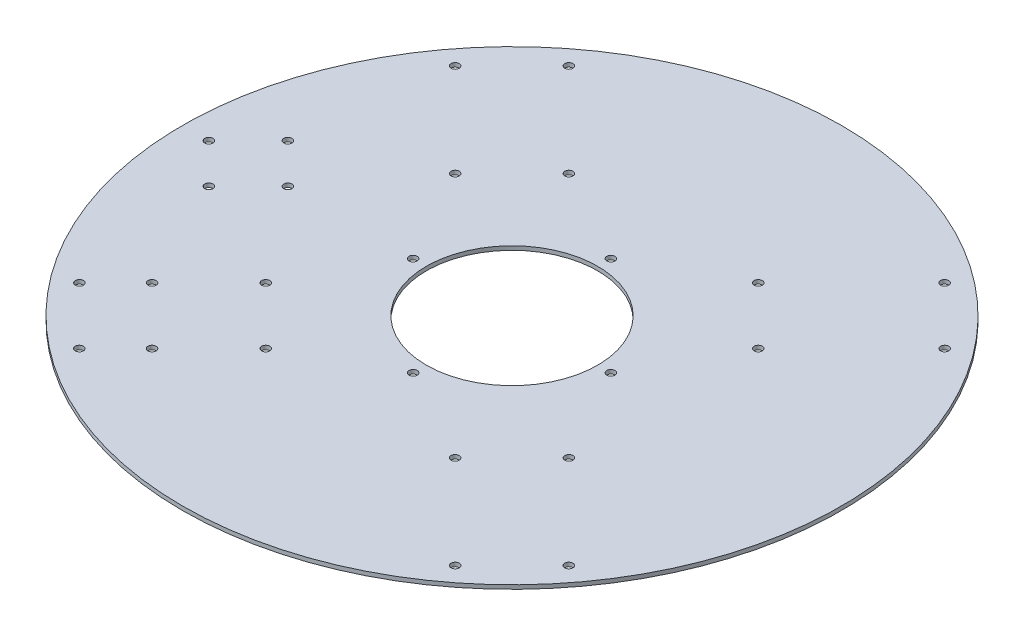
ISO-10303-21;
HEADER;
FILE_DESCRIPTION(('STEP AP214'),'2;1');
FILE_NAME('part.step','',(''),(''),'','','');
FILE_SCHEMA(('AUTOMOTIVE_DESIGN { 1 0 10303 214 1 1 1 1 }'));
ENDSEC;
DATA;
#1=APPLICATION_CONTEXT('core data for automotive mechanical design processes');
#2=APPLICATION_PROTOCOL_DEFINITION('international standard','automotive_design',2000,#1);
#3=PRODUCT_CONTEXT('',#1,'mechanical');
#4=PRODUCT('Part','Part','',(#3));
#5=PRODUCT_RELATED_PRODUCT_CATEGORY('part','',(#4));
#6=PRODUCT_DEFINITION_FORMATION('','',#4);
#7=PRODUCT_DEFINITION_CONTEXT('part definition',#1,'design');
#8=PRODUCT_DEFINITION('design','',#6,#7);
#9=PRODUCT_DEFINITION_SHAPE('','',#8);
#10=(LENGTH_UNIT() NAMED_UNIT(*) SI_UNIT(.MILLI.,.METRE.));
#11=(NAMED_UNIT(*) PLANE_ANGLE_UNIT() SI_UNIT($,.RADIAN.));
#12=(NAMED_UNIT(*) SI_UNIT($,.STERADIAN.) SOLID_ANGLE_UNIT());
#13=UNCERTAINTY_MEASURE_WITH_UNIT(LENGTH_MEASURE(1.E-05),#10,'distance_accuracy_value','');
#14=(GEOMETRIC_REPRESENTATION_CONTEXT(3) GLOBAL_UNCERTAINTY_ASSIGNED_CONTEXT((#13)) GLOBAL_UNIT_ASSIGNED_CONTEXT((#10,
#11,#12)) REPRESENTATION_CONTEXT('',''));
#15=CARTESIAN_POINT('',(0.,0.,0.));
#16=DIRECTION('',(0.,0.,1.));
#17=DIRECTION('',(1.,0.,0.));
#18=AXIS2_PLACEMENT_3D('',#15,#16,#17);
#19=CARTESIAN_POINT('',(0.,1.5,0.));
#20=DIRECTION('',(0.,-1.,0.));
#21=DIRECTION('',(0.,0.,-1.));
#22=AXIS2_PLACEMENT_3D('',#19,#20,#21);
#23=CYLINDRICAL_SURFACE('',#22,32.5);
#24=CARTESIAN_POINT('',(0.,1.5,0.));
#25=DIRECTION('',(0.,1.,0.));
#26=DIRECTION('',(0.,0.,1.));
#27=AXIS2_PLACEMENT_3D('',#24,#25,#26);
#28=CIRCLE('',#27,32.5);
#29=CARTESIAN_POINT('',(0.,1.5,32.5));
#30=VERTEX_POINT('',#29);
#31=EDGE_CURVE('E49',#30,#30,#28,.T.);
#32=ORIENTED_EDGE('',*,*,#31,.T.);
#33=EDGE_LOOP('',(#32));
#34=FACE_BOUND('',#33,.T.);
#35=CARTESIAN_POINT('',(0.,0.,0.));
#36=DIRECTION('',(0.,1.,0.));
#37=DIRECTION('',(0.,0.,1.));
#38=AXIS2_PLACEMENT_3D('',#35,#36,#37);
#39=CIRCLE('',#38,32.5);
#40=CARTESIAN_POINT('',(0.,0.,32.5));
#41=VERTEX_POINT('',#40);
#42=EDGE_CURVE('E75',#41,#41,#39,.T.);
#43=ORIENTED_EDGE('',*,*,#42,.F.);
#44=EDGE_LOOP('',(#43));
#45=FACE_BOUND('',#44,.T.);
#46=ADVANCED_FACE('F40',(#34,#45),#23,.F.);
#47=CARTESIAN_POINT('',(-37.5,1.5,0.));
#48=DIRECTION('',(0.,-1.,0.));
#49=DIRECTION('',(0.,0.,-1.));
#50=AXIS2_PLACEMENT_3D('',#47,#48,#49);
#51=CYLINDRICAL_SURFACE('',#50,1.55);
#52=CARTESIAN_POINT('',(-37.5,1.5,0.));
#53=DIRECTION('',(0.,1.,0.));
#54=DIRECTION('',(0.,0.,1.));
#55=AXIS2_PLACEMENT_3D('',#52,#53,#54);
#56=CIRCLE('',#55,1.55);
#57=CARTESIAN_POINT('',(-37.5,1.5,1.55));
#58=VERTEX_POINT('',#57);
#59=EDGE_CURVE('E55',#58,#58,#56,.T.);
#60=ORIENTED_EDGE('',*,*,#59,.T.);
#61=EDGE_LOOP('',(#60));
#62=FACE_BOUND('',#61,.T.);
#63=CARTESIAN_POINT('',(-37.5,0.,0.));
#64=DIRECTION('',(0.,1.,0.));
#65=DIRECTION('',(0.,0.,1.));
#66=AXIS2_PLACEMENT_3D('',#63,#64,#65);
#67=CIRCLE('',#66,1.55);
#68=CARTESIAN_POINT('',(-37.5,0.,1.55));
#69=VERTEX_POINT('',#68);
#70=EDGE_CURVE('E72',#69,#69,#67,.T.);
#71=ORIENTED_EDGE('',*,*,#70,.F.);
#72=EDGE_LOOP('',(#71));
#73=FACE_BOUND('',#72,.T.);
#74=ADVANCED_FACE('F104',(#62,#73),#51,.F.);
#75=CARTESIAN_POINT('',(37.5,1.5,0.));
#76=DIRECTION('',(0.,-1.,0.));
#77=DIRECTION('',(0.,0.,-1.));
#78=AXIS2_PLACEMENT_3D('',#75,#76,#77);
#79=CYLINDRICAL_SURFACE('',#78,1.55);
#80=CARTESIAN_POINT('',(37.5,1.5,0.));
#81=DIRECTION('',(0.,1.,0.));
#82=DIRECTION('',(0.,0.,1.));
#83=AXIS2_PLACEMENT_3D('',#80,#81,#82);
#84=CIRCLE('',#83,1.55);
#85=CARTESIAN_POINT('',(37.5,1.5,1.55));
#86=VERTEX_POINT('',#85);
#87=EDGE_CURVE('E93',#86,#86,#84,.T.);
#88=ORIENTED_EDGE('',*,*,#87,.T.);
#89=EDGE_LOOP('',(#88));
#90=FACE_BOUND('',#89,.T.);
#91=CARTESIAN_POINT('',(37.5,0.,0.));
#92=DIRECTION('',(0.,1.,0.));
#93=DIRECTION('',(0.,0.,1.));
#94=AXIS2_PLACEMENT_3D('',#91,#92,#93);
#95=CIRCLE('',#94,1.55);
#96=CARTESIAN_POINT('',(37.5,0.,1.55));
#97=VERTEX_POINT('',#96);
#98=EDGE_CURVE('E68',#97,#97,#95,.T.);
#99=ORIENTED_EDGE('',*,*,#98,.F.);
#100=EDGE_LOOP('',(#99));
#101=FACE_BOUND('',#100,.T.);
#102=ADVANCED_FACE('F122',(#90,#101),#79,.F.);
#103=CARTESIAN_POINT('',(0.,1.5,-37.5));
#104=DIRECTION('',(0.,-1.,0.));
#105=DIRECTION('',(0.,0.,-1.));
#106=AXIS2_PLACEMENT_3D('',#103,#104,#105);
#107=CYLINDRICAL_SURFACE('',#106,1.54999999999999);
#108=CARTESIAN_POINT('',(0.,1.5,-37.5));
#109=DIRECTION('',(0.,1.,0.));
#110=DIRECTION('',(0.,0.,1.));
#111=AXIS2_PLACEMENT_3D('',#108,#109,#110);
#112=CIRCLE('',#111,1.54999999999999);
#113=CARTESIAN_POINT('',(0.,1.5,-35.95));
#114=VERTEX_POINT('',#113);
#115=EDGE_CURVE('E87',#114,#114,#112,.T.);
#116=ORIENTED_EDGE('',*,*,#115,.T.);
#117=EDGE_LOOP('',(#116));
#118=FACE_BOUND('',#117,.T.);
#119=CARTESIAN_POINT('',(0.,0.,-37.5));
#120=DIRECTION('',(0.,1.,0.));
#121=DIRECTION('',(0.,0.,1.));
#122=AXIS2_PLACEMENT_3D('',#119,#120,#121);
#123=CIRCLE('',#122,1.54999999999999);
#124=CARTESIAN_POINT('',(0.,0.,-35.95));
#125=VERTEX_POINT('',#124);
#126=EDGE_CURVE('E63',#125,#125,#123,.T.);
#127=ORIENTED_EDGE('',*,*,#126,.F.);
#128=EDGE_LOOP('',(#127));
#129=FACE_BOUND('',#128,.T.);
#130=ADVANCED_FACE('F128',(#118,#129),#107,.F.);
#131=CARTESIAN_POINT('',(0.,1.5,37.5));
#132=DIRECTION('',(0.,-1.,0.));
#133=DIRECTION('',(0.,0.,-1.));
#134=AXIS2_PLACEMENT_3D('',#131,#132,#133);
#135=CYLINDRICAL_SURFACE('',#134,1.54999999999999);
#136=CARTESIAN_POINT('',(0.,1.5,37.5));
#137=DIRECTION('',(0.,1.,0.));
#138=DIRECTION('',(0.,0.,1.));
#139=AXIS2_PLACEMENT_3D('',#136,#137,#138);
#140=CIRCLE('',#139,1.54999999999999);
#141=CARTESIAN_POINT('',(0.,1.5,39.05));
#142=VERTEX_POINT('',#141);
#143=EDGE_CURVE('E82',#142,#142,#140,.T.);
#144=ORIENTED_EDGE('',*,*,#143,.T.);
#145=EDGE_LOOP('',(#144));
#146=FACE_BOUND('',#145,.T.);
#147=CARTESIAN_POINT('',(0.,0.,37.5));
#148=DIRECTION('',(0.,1.,0.));
#149=DIRECTION('',(0.,0.,1.));
#150=AXIS2_PLACEMENT_3D('',#147,#148,#149);
#151=CIRCLE('',#150,1.54999999999999);
#152=CARTESIAN_POINT('',(0.,0.,39.05));
#153=VERTEX_POINT('',#152);
#154=EDGE_CURVE('E59',#153,#153,#151,.T.);
#155=ORIENTED_EDGE('',*,*,#154,.F.);
#156=EDGE_LOOP('',(#155));
#157=FACE_BOUND('',#156,.T.);
#158=ADVANCED_FACE('F42',(#146,#157),#135,.F.);
#159=CARTESIAN_POINT('',(0.,1.5,0.));
#160=DIRECTION('',(0.,-1.,0.));
#161=DIRECTION('',(0.,0.,-1.));
#162=AXIS2_PLACEMENT_3D('',#159,#160,#161);
#163=CYLINDRICAL_SURFACE('',#162,125.);
#164=CARTESIAN_POINT('',(0.,1.5,0.));
#165=DIRECTION('',(0.,1.,0.));
#166=DIRECTION('',(0.,0.,1.));
#167=AXIS2_PLACEMENT_3D('',#164,#165,#166);
#168=CIRCLE('',#167,125.);
#169=CARTESIAN_POINT('',(0.,1.5,125.));
#170=VERTEX_POINT('',#169);
#171=EDGE_CURVE('E10',#170,#170,#168,.T.);
#172=ORIENTED_EDGE('',*,*,#171,.F.);
#173=EDGE_LOOP('',(#172));
#174=FACE_BOUND('',#173,.T.);
#175=CARTESIAN_POINT('',(0.,0.,0.));
#176=DIRECTION('',(0.,1.,0.));
#177=DIRECTION('',(0.,0.,1.));
#178=AXIS2_PLACEMENT_3D('',#175,#176,#177);
#179=CIRCLE('',#178,125.);
#180=CARTESIAN_POINT('',(0.,0.,125.));
#181=VERTEX_POINT('',#180);
#182=EDGE_CURVE('E44',#181,#181,#179,.T.);
#183=ORIENTED_EDGE('',*,*,#182,.T.);
#184=EDGE_LOOP('',(#183));
#185=FACE_BOUND('',#184,.T.);
#186=ADVANCED_FACE('F111',(#174,#185),#163,.T.);
#187=CARTESIAN_POINT('',(0.,1.5,0.));
#188=DIRECTION('',(0.,1.,0.));
#189=DIRECTION('',(0.,0.,1.));
#190=AXIS2_PLACEMENT_3D('',#187,#188,#189);
#191=PLANE('',#190);
#192=CARTESIAN_POINT('',(-100.,1.5,-15.));
#193=DIRECTION('',(0.,1.,0.));
#194=DIRECTION('',(0.,0.,1.));
#195=AXIS2_PLACEMENT_3D('',#192,#193,#194);
#196=CIRCLE('',#195,1.54999999999999);
#197=CARTESIAN_POINT('',(-100.,1.5,-13.45));
#198=VERTEX_POINT('',#197);
#199=EDGE_CURVE('E247',#198,#198,#196,.T.);
#200=ORIENTED_EDGE('',*,*,#199,.F.);
#201=EDGE_LOOP('',(#200));
#202=FACE_BOUND('',#201,.T.);
#203=CARTESIAN_POINT('',(-100.,1.5,15.));
#204=DIRECTION('',(0.,1.,0.));
#205=DIRECTION('',(0.,0.,1.));
#206=AXIS2_PLACEMENT_3D('',#203,#204,#205);
#207=CIRCLE('',#206,1.54999999999999);
#208=CARTESIAN_POINT('',(-100.,1.5,16.55));
#209=VERTEX_POINT('',#208);
#210=EDGE_CURVE('E256',#209,#209,#207,.T.);
#211=ORIENTED_EDGE('',*,*,#210,.F.);
#212=EDGE_LOOP('',(#211));
#213=FACE_BOUND('',#212,.T.);
#214=CARTESIAN_POINT('',(-85.,1.5,0.));
#215=DIRECTION('',(0.,1.,0.));
#216=DIRECTION('',(0.,0.,1.));
#217=AXIS2_PLACEMENT_3D('',#214,#215,#216);
#218=CIRCLE('',#217,1.54999999999999);
#219=CARTESIAN_POINT('',(-85.,1.5,1.54999999999999));
#220=VERTEX_POINT('',#219);
#221=EDGE_CURVE('E263',#220,#220,#218,.T.);
#222=ORIENTED_EDGE('',*,*,#221,.F.);
#223=EDGE_LOOP('',(#222));
#224=FACE_BOUND('',#223,.T.);
#225=CARTESIAN_POINT('',(-115.,1.5,0.));
#226=DIRECTION('',(0.,1.,0.));
#227=DIRECTION('',(0.,0.,1.));
#228=AXIS2_PLACEMENT_3D('',#225,#226,#227);
#229=CIRCLE('',#228,1.54999999999999);
#230=CARTESIAN_POINT('',(-115.,1.5,1.54999999999999));
#231=VERTEX_POINT('',#230);
#232=EDGE_CURVE('E271',#231,#231,#229,.T.);
#233=ORIENTED_EDGE('',*,*,#232,.F.);
#234=EDGE_LOOP('',(#233));
#235=FACE_BOUND('',#234,.T.);
#236=CARTESIAN_POINT('',(-92.8358294537558,1.5,71.2690655815099));
#237=DIRECTION('',(0.,1.,0.));
#238=DIRECTION('',(0.,0.,1.));
#239=AXIS2_PLACEMENT_3D('',#236,#237,#238);
#240=CIRCLE('',#239,1.5500000006089);
#241=CARTESIAN_POINT('',(-92.8358294537558,1.5,72.8190655821188));
#242=VERTEX_POINT('',#241);
#243=EDGE_CURVE('E336',#242,#242,#240,.T.);
#244=ORIENTED_EDGE('',*,*,#243,.F.);
#245=EDGE_LOOP('',(#244));
#246=FACE_BOUND('',#245,.T.);
#247=CARTESIAN_POINT('',(-57.480490394428,1.5,35.9137265221828));
#248=DIRECTION('',(0.,1.,0.));
#249=DIRECTION('',(0.,0.,1.));
#250=AXIS2_PLACEMENT_3D('',#247,#248,#249);
#251=CIRCLE('',#250,1.55000000060893);
#252=CARTESIAN_POINT('',(-57.480490394428,1.5,37.4637265227917));
#253=VERTEX_POINT('',#252);
#254=EDGE_CURVE('E329',#253,#253,#251,.T.);
#255=ORIENTED_EDGE('',*,*,#254,.F.);
#256=EDGE_LOOP('',(#255));
#257=FACE_BOUND('',#256,.T.);
#258=CARTESIAN_POINT('',(-71.2690726275662,1.5,92.8358224076997));
#259=DIRECTION('',(0.,1.,0.));
#260=DIRECTION('',(0.,0.,1.));
#261=AXIS2_PLACEMENT_3D('',#258,#259,#260);
#262=CIRCLE('',#261,1.5500000006089);
#263=CARTESIAN_POINT('',(-71.2690726275662,1.5,94.3858224083085));
#264=VERTEX_POINT('',#263);
#265=EDGE_CURVE('E320',#264,#264,#262,.T.);
#266=ORIENTED_EDGE('',*,*,#265,.F.);
#267=EDGE_LOOP('',(#266));
#268=FACE_BOUND('',#267,.T.);
#269=CARTESIAN_POINT('',(-35.913733568239,1.5,57.480483348372));
#270=DIRECTION('',(0.,1.,0.));
#271=DIRECTION('',(0.,0.,1.));
#272=AXIS2_PLACEMENT_3D('',#269,#270,#271);
#273=CIRCLE('',#272,1.55000000060893);
#274=CARTESIAN_POINT('',(-35.913733568239,1.5,59.030483348981));
#275=VERTEX_POINT('',#274);
#276=EDGE_CURVE('E285',#275,#275,#273,.T.);
#277=ORIENTED_EDGE('',*,*,#276,.F.);
#278=EDGE_LOOP('',(#277));
#279=FACE_BOUND('',#278,.T.);
#280=CARTESIAN_POINT('',(71.2690655616654,1.5,92.8358294308102));
#281=DIRECTION('',(0.,1.,0.));
#282=DIRECTION('',(0.,0.,1.));
#283=AXIS2_PLACEMENT_3D('',#280,#281,#282);
#284=CIRCLE('',#283,1.55000000465981);
#285=CARTESIAN_POINT('',(71.2690655616654,1.5,94.38582943547));
#286=VERTEX_POINT('',#285);
#287=EDGE_CURVE('E304',#286,#286,#284,.T.);
#288=ORIENTED_EDGE('',*,*,#287,.F.);
#289=EDGE_LOOP('',(#288));
#290=FACE_BOUND('',#289,.T.);
#291=CARTESIAN_POINT('',(35.9137265023384,1.5,57.4804903714824));
#292=DIRECTION('',(0.,1.,0.));
#293=DIRECTION('',(0.,0.,1.));
#294=AXIS2_PLACEMENT_3D('',#291,#292,#293);
#295=CIRCLE('',#294,1.5500000046598);
#296=CARTESIAN_POINT('',(35.9137265023384,1.5,59.0304903761422));
#297=VERTEX_POINT('',#296);
#298=EDGE_CURVE('E295',#297,#297,#295,.T.);
#299=ORIENTED_EDGE('',*,*,#298,.F.);
#300=EDGE_LOOP('',(#299));
#301=FACE_BOUND('',#300,.T.);
#302=CARTESIAN_POINT('',(92.8358223878552,1.5,71.2690726046206));
#303=DIRECTION('',(0.,1.,0.));
#304=DIRECTION('',(0.,0.,1.));
#305=AXIS2_PLACEMENT_3D('',#302,#303,#304);
#306=CIRCLE('',#305,1.55000000465981);
#307=CARTESIAN_POINT('',(92.8358223878552,1.5,72.8190726092804));
#308=VERTEX_POINT('',#307);
#309=EDGE_CURVE('E286',#308,#308,#306,.T.);
#310=ORIENTED_EDGE('',*,*,#309,.F.);
#311=EDGE_LOOP('',(#310));
#312=FACE_BOUND('',#311,.T.);
#313=CARTESIAN_POINT('',(57.4804833285276,1.5,35.9137335452934));
#314=DIRECTION('',(0.,1.,0.));
#315=DIRECTION('',(0.,0.,1.));
#316=AXIS2_PLACEMENT_3D('',#313,#314,#315);
#317=CIRCLE('',#316,1.55000000465983);
#318=CARTESIAN_POINT('',(57.4804833285276,1.5,37.4637335499532));
#319=VERTEX_POINT('',#318);
#320=EDGE_CURVE('E296',#319,#319,#317,.T.);
#321=ORIENTED_EDGE('',*,*,#320,.F.);
#322=EDGE_LOOP('',(#321));
#323=FACE_BOUND('',#322,.T.);
#324=CARTESIAN_POINT('',(92.8358294109658,1.5,-71.269065584611));
#325=DIRECTION('',(0.,1.,0.));
#326=DIRECTION('',(0.,0.,1.));
#327=AXIS2_PLACEMENT_3D('',#324,#325,#326);
#328=CIRCLE('',#327,1.55000000095159);
#329=CARTESIAN_POINT('',(92.8358294109658,1.5,-69.7190655836594));
#330=VERTEX_POINT('',#329);
#331=EDGE_CURVE('E400',#330,#330,#328,.T.);
#332=ORIENTED_EDGE('',*,*,#331,.F.);
#333=EDGE_LOOP('',(#332));
#334=FACE_BOUND('',#333,.T.);
#335=CARTESIAN_POINT('',(57.480490351638,1.5,-35.913726525284));
#336=DIRECTION('',(0.,1.,0.));
#337=DIRECTION('',(0.,0.,1.));
#338=AXIS2_PLACEMENT_3D('',#335,#336,#337);
#339=CIRCLE('',#338,1.55000000095159);
#340=CARTESIAN_POINT('',(57.480490351638,1.5,-34.3637265243324));
#341=VERTEX_POINT('',#340);
#342=EDGE_CURVE('E393',#341,#341,#339,.T.);
#343=ORIENTED_EDGE('',*,*,#342,.F.);
#344=EDGE_LOOP('',(#343));
#345=FACE_BOUND('',#344,.T.);
#346=CARTESIAN_POINT('',(71.2690725847761,1.5,-92.8358224108008));
#347=DIRECTION('',(0.,1.,0.));
#348=DIRECTION('',(0.,0.,1.));
#349=AXIS2_PLACEMENT_3D('',#346,#347,#348);
#350=CIRCLE('',#349,1.55000000095158);
#351=CARTESIAN_POINT('',(71.2690725847761,1.5,-91.2858224098492));
#352=VERTEX_POINT('',#351);
#353=EDGE_CURVE('E384',#352,#352,#350,.T.);
#354=ORIENTED_EDGE('',*,*,#353,.F.);
#355=EDGE_LOOP('',(#354));
#356=FACE_BOUND('',#355,.T.);
#357=CARTESIAN_POINT('',(35.913733525449,1.5,-57.4804833514732));
#358=DIRECTION('',(0.,1.,0.));
#359=DIRECTION('',(0.,0.,1.));
#360=AXIS2_PLACEMENT_3D('',#357,#358,#359);
#361=CIRCLE('',#360,1.55000000095158);
#362=CARTESIAN_POINT('',(35.913733525449,1.5,-55.9304833505216));
#363=VERTEX_POINT('',#362);
#364=EDGE_CURVE('E313',#363,#363,#361,.T.);
#365=ORIENTED_EDGE('',*,*,#364,.F.);
#366=EDGE_LOOP('',(#365));
#367=FACE_BOUND('',#366,.T.);
#368=CARTESIAN_POINT('',(-57.4804903944286,1.5,79.0472401745619));
#369=DIRECTION('',(0.,1.,0.));
#370=DIRECTION('',(0.,0.,1.));
#371=AXIS2_PLACEMENT_3D('',#368,#369,#370);
#372=CIRCLE('',#371,1.54999999967471);
#373=CARTESIAN_POINT('',(-57.4804903944286,1.5,80.5972401742366));
#374=VERTEX_POINT('',#373);
#375=EDGE_CURVE('E376',#374,#374,#372,.T.);
#376=ORIENTED_EDGE('',*,*,#375,.F.);
#377=EDGE_LOOP('',(#376));
#378=FACE_BOUND('',#377,.T.);
#379=CARTESIAN_POINT('',(-57.4804833713176,1.5,-35.9137335483946));
#380=DIRECTION('',(0.,1.,0.));
#381=DIRECTION('',(0.,0.,1.));
#382=AXIS2_PLACEMENT_3D('',#379,#380,#381);
#383=CIRCLE('',#382,1.54999999472888);
#384=CARTESIAN_POINT('',(-57.4804833713176,1.5,-34.3637335536657));
#385=VERTEX_POINT('',#384);
#386=EDGE_CURVE('E368',#385,#385,#383,.T.);
#387=ORIENTED_EDGE('',*,*,#386,.F.);
#388=EDGE_LOOP('',(#387));
#389=FACE_BOUND('',#388,.T.);
#390=CARTESIAN_POINT('',(-92.8358224306452,1.5,-71.2690726077218));
#391=DIRECTION('',(0.,1.,0.));
#392=DIRECTION('',(0.,0.,1.));
#393=AXIS2_PLACEMENT_3D('',#390,#391,#392);
#394=CIRCLE('',#393,1.54999999472889);
#395=CARTESIAN_POINT('',(-92.8358224306452,1.5,-69.7190726129929));
#396=VERTEX_POINT('',#395);
#397=EDGE_CURVE('E360',#396,#396,#394,.T.);
#398=ORIENTED_EDGE('',*,*,#397,.F.);
#399=EDGE_LOOP('',(#398));
#400=FACE_BOUND('',#399,.T.);
#401=CARTESIAN_POINT('',(-35.9137265451284,1.5,-57.4804903745836));
#402=DIRECTION('',(0.,1.,0.));
#403=DIRECTION('',(0.,0.,1.));
#404=AXIS2_PLACEMENT_3D('',#401,#402,#403);
#405=CIRCLE('',#404,1.54999999472891);
#406=CARTESIAN_POINT('',(-35.9137265451284,1.5,-55.9304903798547));
#407=VERTEX_POINT('',#406);
#408=EDGE_CURVE('E350',#407,#407,#405,.T.);
#409=ORIENTED_EDGE('',*,*,#408,.F.);
#410=EDGE_LOOP('',(#409));
#411=FACE_BOUND('',#410,.T.);
#412=CARTESIAN_POINT('',(-79.0472472206184,1.5,57.4804833483723));
#413=DIRECTION('',(0.,1.,0.));
#414=DIRECTION('',(0.,0.,1.));
#415=AXIS2_PLACEMENT_3D('',#412,#413,#414);
#416=CIRCLE('',#415,1.54999999967472);
#417=CARTESIAN_POINT('',(-79.0472472206184,1.5,59.030483348047));
#418=VERTEX_POINT('',#417);
#419=EDGE_CURVE('E253',#418,#418,#416,.T.);
#420=ORIENTED_EDGE('',*,*,#419,.F.);
#421=EDGE_LOOP('',(#420));
#422=FACE_BOUND('',#421,.T.);
#423=CARTESIAN_POINT('',(-71.2690656044554,1.5,-92.8358294339114));
#424=DIRECTION('',(0.,1.,0.));
#425=DIRECTION('',(0.,0.,1.));
#426=AXIS2_PLACEMENT_3D('',#423,#424,#425);
#427=CIRCLE('',#426,1.54999999472889);
#428=CARTESIAN_POINT('',(-71.2690656044554,1.5,-91.2858294391825));
#429=VERTEX_POINT('',#428);
#430=EDGE_CURVE('E359',#429,#429,#427,.T.);
#431=ORIENTED_EDGE('',*,*,#430,.F.);
#432=EDGE_LOOP('',(#431));
#433=FACE_BOUND('',#432,.T.);
#434=ORIENTED_EDGE('',*,*,#143,.F.);
#435=EDGE_LOOP('',(#434));
#436=FACE_BOUND('',#435,.T.);
#437=ORIENTED_EDGE('',*,*,#115,.F.);
#438=EDGE_LOOP('',(#437));
#439=FACE_BOUND('',#438,.T.);
#440=ORIENTED_EDGE('',*,*,#87,.F.);
#441=EDGE_LOOP('',(#440));
#442=FACE_BOUND('',#441,.T.);
#443=ORIENTED_EDGE('',*,*,#59,.F.);
#444=EDGE_LOOP('',(#443));
#445=FACE_BOUND('',#444,.T.);
#446=ORIENTED_EDGE('',*,*,#31,.F.);
#447=EDGE_LOOP('',(#446));
#448=FACE_BOUND('',#447,.T.);
#449=ORIENTED_EDGE('',*,*,#171,.T.);
#450=EDGE_LOOP('',(#449));
#451=FACE_BOUND('',#450,.T.);
#452=ADVANCED_FACE('F107',(#202,#213,#224,#235,#246,#257,#268,#279,#290,#301,#312,#323,#334,
#345,#356,#367,#378,#389,#400,#411,#422,#433,#436,#439,#442,#445,#448,#451),#191,.T.);
#453=CARTESIAN_POINT('',(0.,0.,0.));
#454=DIRECTION('',(0.,1.,0.));
#455=DIRECTION('',(0.,0.,1.));
#456=AXIS2_PLACEMENT_3D('',#453,#454,#455);
#457=PLANE('',#456);
#458=CARTESIAN_POINT('',(-100.,0.,-15.));
#459=DIRECTION('',(0.,1.,0.));
#460=DIRECTION('',(0.,0.,1.));
#461=AXIS2_PLACEMENT_3D('',#458,#459,#460);
#462=CIRCLE('',#461,1.54999999999999);
#463=CARTESIAN_POINT('',(-100.,0.,-13.45));
#464=VERTEX_POINT('',#463);
#465=EDGE_CURVE('E244',#464,#464,#462,.F.);
#466=ORIENTED_EDGE('',*,*,#465,.F.);
#467=EDGE_LOOP('',(#466));
#468=FACE_BOUND('',#467,.T.);
#469=CARTESIAN_POINT('',(-100.,0.,15.));
#470=DIRECTION('',(0.,1.,0.));
#471=DIRECTION('',(0.,0.,1.));
#472=AXIS2_PLACEMENT_3D('',#469,#470,#471);
#473=CIRCLE('',#472,1.54999999999999);
#474=CARTESIAN_POINT('',(-100.,0.,16.55));
#475=VERTEX_POINT('',#474);
#476=EDGE_CURVE('E249',#475,#475,#473,.F.);
#477=ORIENTED_EDGE('',*,*,#476,.F.);
#478=EDGE_LOOP('',(#477));
#479=FACE_BOUND('',#478,.T.);
#480=CARTESIAN_POINT('',(-85.,0.,0.));
#481=DIRECTION('',(0.,1.,0.));
#482=DIRECTION('',(0.,0.,1.));
#483=AXIS2_PLACEMENT_3D('',#480,#481,#482);
#484=CIRCLE('',#483,1.54999999999999);
#485=CARTESIAN_POINT('',(-85.,0.,1.54999999999999));
#486=VERTEX_POINT('',#485);
#487=EDGE_CURVE('E261',#486,#486,#484,.F.);
#488=ORIENTED_EDGE('',*,*,#487,.F.);
#489=EDGE_LOOP('',(#488));
#490=FACE_BOUND('',#489,.T.);
#491=CARTESIAN_POINT('',(-115.,0.,0.));
#492=DIRECTION('',(0.,1.,0.));
#493=DIRECTION('',(0.,0.,1.));
#494=AXIS2_PLACEMENT_3D('',#491,#492,#493);
#495=CIRCLE('',#494,1.54999999999999);
#496=CARTESIAN_POINT('',(-115.,0.,1.54999999999999));
#497=VERTEX_POINT('',#496);
#498=EDGE_CURVE('E267',#497,#497,#495,.F.);
#499=ORIENTED_EDGE('',*,*,#498,.F.);
#500=EDGE_LOOP('',(#499));
#501=FACE_BOUND('',#500,.T.);
#502=CARTESIAN_POINT('',(-92.8358294537558,0.,71.2690655815099));
#503=DIRECTION('',(0.,1.,0.));
#504=DIRECTION('',(0.,0.,1.));
#505=AXIS2_PLACEMENT_3D('',#502,#503,#504);
#506=CIRCLE('',#505,1.5500000006089);
#507=CARTESIAN_POINT('',(-92.8358294537558,0.,72.8190655821188));
#508=VERTEX_POINT('',#507);
#509=EDGE_CURVE('E300',#508,#508,#506,.F.);
#510=ORIENTED_EDGE('',*,*,#509,.F.);
#511=EDGE_LOOP('',(#510));
#512=FACE_BOUND('',#511,.T.);
#513=CARTESIAN_POINT('',(-57.480490394428,0.,35.9137265221828));
#514=DIRECTION('',(0.,1.,0.));
#515=DIRECTION('',(0.,0.,1.));
#516=AXIS2_PLACEMENT_3D('',#513,#514,#515);
#517=CIRCLE('',#516,1.55000000060893);
#518=CARTESIAN_POINT('',(-57.480490394428,0.,37.4637265227917));
#519=VERTEX_POINT('',#518);
#520=EDGE_CURVE('E340',#519,#519,#517,.F.);
#521=ORIENTED_EDGE('',*,*,#520,.F.);
#522=EDGE_LOOP('',(#521));
#523=FACE_BOUND('',#522,.T.);
#524=CARTESIAN_POINT('',(-71.2690726275662,0.,92.8358224076997));
#525=DIRECTION('',(0.,1.,0.));
#526=DIRECTION('',(0.,0.,1.));
#527=AXIS2_PLACEMENT_3D('',#524,#525,#526);
#528=CIRCLE('',#527,1.5500000006089);
#529=CARTESIAN_POINT('',(-71.2690726275662,0.,94.3858224083085));
#530=VERTEX_POINT('',#529);
#531=EDGE_CURVE('E324',#530,#530,#528,.F.);
#532=ORIENTED_EDGE('',*,*,#531,.F.);
#533=EDGE_LOOP('',(#532));
#534=FACE_BOUND('',#533,.T.);
#535=CARTESIAN_POINT('',(-35.913733568239,0.,57.480483348372));
#536=DIRECTION('',(0.,1.,0.));
#537=DIRECTION('',(0.,0.,1.));
#538=AXIS2_PLACEMENT_3D('',#535,#536,#537);
#539=CIRCLE('',#538,1.55000000060893);
#540=CARTESIAN_POINT('',(-35.913733568239,0.,59.030483348981));
#541=VERTEX_POINT('',#540);
#542=EDGE_CURVE('E325',#541,#541,#539,.F.);
#543=ORIENTED_EDGE('',*,*,#542,.F.);
#544=EDGE_LOOP('',(#543));
#545=FACE_BOUND('',#544,.T.);
#546=CARTESIAN_POINT('',(71.2690655616654,0.,92.8358294308102));
#547=DIRECTION('',(0.,1.,0.));
#548=DIRECTION('',(0.,0.,1.));
#549=AXIS2_PLACEMENT_3D('',#546,#547,#548);
#550=CIRCLE('',#549,1.55000000465981);
#551=CARTESIAN_POINT('',(71.2690655616654,0.,94.38582943547));
#552=VERTEX_POINT('',#551);
#553=EDGE_CURVE('E308',#552,#552,#550,.F.);
#554=ORIENTED_EDGE('',*,*,#553,.F.);
#555=EDGE_LOOP('',(#554));
#556=FACE_BOUND('',#555,.T.);
#557=CARTESIAN_POINT('',(35.9137265023384,0.,57.4804903714824));
#558=DIRECTION('',(0.,1.,0.));
#559=DIRECTION('',(0.,0.,1.));
#560=AXIS2_PLACEMENT_3D('',#557,#558,#559);
#561=CIRCLE('',#560,1.5500000046598);
#562=CARTESIAN_POINT('',(35.9137265023384,0.,59.0304903761422));
#563=VERTEX_POINT('',#562);
#564=EDGE_CURVE('E309',#563,#563,#561,.F.);
#565=ORIENTED_EDGE('',*,*,#564,.F.);
#566=EDGE_LOOP('',(#565));
#567=FACE_BOUND('',#566,.T.);
#568=CARTESIAN_POINT('',(92.8358223878552,0.,71.2690726046206));
#569=DIRECTION('',(0.,1.,0.));
#570=DIRECTION('',(0.,0.,1.));
#571=AXIS2_PLACEMENT_3D('',#568,#569,#570);
#572=CIRCLE('',#571,1.55000000465981);
#573=CARTESIAN_POINT('',(92.8358223878552,0.,72.8190726092804));
#574=VERTEX_POINT('',#573);
#575=EDGE_CURVE('E290',#574,#574,#572,.F.);
#576=ORIENTED_EDGE('',*,*,#575,.F.);
#577=EDGE_LOOP('',(#576));
#578=FACE_BOUND('',#577,.T.);
#579=CARTESIAN_POINT('',(57.4804833285276,0.,35.9137335452934));
#580=DIRECTION('',(0.,1.,0.));
#581=DIRECTION('',(0.,0.,1.));
#582=AXIS2_PLACEMENT_3D('',#579,#580,#581);
#583=CIRCLE('',#582,1.55000000465983);
#584=CARTESIAN_POINT('',(57.4804833285276,0.,37.4637335499532));
#585=VERTEX_POINT('',#584);
#586=EDGE_CURVE('E291',#585,#585,#583,.F.);
#587=ORIENTED_EDGE('',*,*,#586,.F.);
#588=EDGE_LOOP('',(#587));
#589=FACE_BOUND('',#588,.T.);
#590=CARTESIAN_POINT('',(92.8358294109658,0.,-71.269065584611));
#591=DIRECTION('',(0.,1.,0.));
#592=DIRECTION('',(0.,0.,1.));
#593=AXIS2_PLACEMENT_3D('',#590,#591,#592);
#594=CIRCLE('',#593,1.55000000095159);
#595=CARTESIAN_POINT('',(92.8358294109658,0.,-69.7190655836594));
#596=VERTEX_POINT('',#595);
#597=EDGE_CURVE('E380',#596,#596,#594,.F.);
#598=ORIENTED_EDGE('',*,*,#597,.F.);
#599=EDGE_LOOP('',(#598));
#600=FACE_BOUND('',#599,.T.);
#601=CARTESIAN_POINT('',(57.480490351638,0.,-35.913726525284));
#602=DIRECTION('',(0.,1.,0.));
#603=DIRECTION('',(0.,0.,1.));
#604=AXIS2_PLACEMENT_3D('',#601,#602,#603);
#605=CIRCLE('',#604,1.55000000095159);
#606=CARTESIAN_POINT('',(57.480490351638,0.,-34.3637265243324));
#607=VERTEX_POINT('',#606);
#608=EDGE_CURVE('E404',#607,#607,#605,.F.);
#609=ORIENTED_EDGE('',*,*,#608,.F.);
#610=EDGE_LOOP('',(#609));
#611=FACE_BOUND('',#610,.T.);
#612=CARTESIAN_POINT('',(71.2690725847761,0.,-92.8358224108008));
#613=DIRECTION('',(0.,1.,0.));
#614=DIRECTION('',(0.,0.,1.));
#615=AXIS2_PLACEMENT_3D('',#612,#613,#614);
#616=CIRCLE('',#615,1.55000000095158);
#617=CARTESIAN_POINT('',(71.2690725847761,0.,-91.2858224098492));
#618=VERTEX_POINT('',#617);
#619=EDGE_CURVE('E388',#618,#618,#616,.F.);
#620=ORIENTED_EDGE('',*,*,#619,.F.);
#621=EDGE_LOOP('',(#620));
#622=FACE_BOUND('',#621,.T.);
#623=CARTESIAN_POINT('',(35.913733525449,0.,-57.4804833514732));
#624=DIRECTION('',(0.,1.,0.));
#625=DIRECTION('',(0.,0.,1.));
#626=AXIS2_PLACEMENT_3D('',#623,#624,#625);
#627=CIRCLE('',#626,1.55000000095158);
#628=CARTESIAN_POINT('',(35.913733525449,0.,-55.9304833505216));
#629=VERTEX_POINT('',#628);
#630=EDGE_CURVE('E389',#629,#629,#627,.F.);
#631=ORIENTED_EDGE('',*,*,#630,.F.);
#632=EDGE_LOOP('',(#631));
#633=FACE_BOUND('',#632,.T.);
#634=CARTESIAN_POINT('',(-57.4804903944286,0.,79.0472401745619));
#635=DIRECTION('',(0.,1.,0.));
#636=DIRECTION('',(0.,0.,1.));
#637=AXIS2_PLACEMENT_3D('',#634,#635,#636);
#638=CIRCLE('',#637,1.54999999967471);
#639=CARTESIAN_POINT('',(-57.4804903944286,0.,80.5972401742366));
#640=VERTEX_POINT('',#639);
#641=EDGE_CURVE('E372',#640,#640,#638,.F.);
#642=ORIENTED_EDGE('',*,*,#641,.F.);
#643=EDGE_LOOP('',(#642));
#644=FACE_BOUND('',#643,.T.);
#645=CARTESIAN_POINT('',(-57.4804833713176,0.,-35.9137335483946));
#646=DIRECTION('',(0.,1.,0.));
#647=DIRECTION('',(0.,0.,1.));
#648=AXIS2_PLACEMENT_3D('',#645,#646,#647);
#649=CIRCLE('',#648,1.54999999472888);
#650=CARTESIAN_POINT('',(-57.4804833713176,0.,-34.3637335536657));
#651=VERTEX_POINT('',#650);
#652=EDGE_CURVE('E364',#651,#651,#649,.F.);
#653=ORIENTED_EDGE('',*,*,#652,.F.);
#654=EDGE_LOOP('',(#653));
#655=FACE_BOUND('',#654,.T.);
#656=CARTESIAN_POINT('',(-92.8358224306452,0.,-71.2690726077218));
#657=DIRECTION('',(0.,1.,0.));
#658=DIRECTION('',(0.,0.,1.));
#659=AXIS2_PLACEMENT_3D('',#656,#657,#658);
#660=CIRCLE('',#659,1.54999999472889);
#661=CARTESIAN_POINT('',(-92.8358224306452,0.,-69.7190726129929));
#662=VERTEX_POINT('',#661);
#663=EDGE_CURVE('E355',#662,#662,#660,.F.);
#664=ORIENTED_EDGE('',*,*,#663,.F.);
#665=EDGE_LOOP('',(#664));
#666=FACE_BOUND('',#665,.T.);
#667=CARTESIAN_POINT('',(-35.9137265451284,0.,-57.4804903745836));
#668=DIRECTION('',(0.,1.,0.));
#669=DIRECTION('',(0.,0.,1.));
#670=AXIS2_PLACEMENT_3D('',#667,#668,#669);
#671=CIRCLE('',#670,1.54999999472891);
#672=CARTESIAN_POINT('',(-35.9137265451284,0.,-55.9304903798547));
#673=VERTEX_POINT('',#672);
#674=EDGE_CURVE('E354',#673,#673,#671,.F.);
#675=ORIENTED_EDGE('',*,*,#674,.F.);
#676=EDGE_LOOP('',(#675));
#677=FACE_BOUND('',#676,.T.);
#678=CARTESIAN_POINT('',(-79.0472472206184,0.,57.4804833483723));
#679=DIRECTION('',(0.,1.,0.));
#680=DIRECTION('',(0.,0.,1.));
#681=AXIS2_PLACEMENT_3D('',#678,#679,#680);
#682=CIRCLE('',#681,1.54999999967472);
#683=CARTESIAN_POINT('',(-79.0472472206184,0.,59.030483348047));
#684=VERTEX_POINT('',#683);
#685=EDGE_CURVE('E281',#684,#684,#682,.F.);
#686=ORIENTED_EDGE('',*,*,#685,.F.);
#687=EDGE_LOOP('',(#686));
#688=FACE_BOUND('',#687,.T.);
#689=CARTESIAN_POINT('',(-71.2690656044554,0.,-92.8358294339114));
#690=DIRECTION('',(0.,1.,0.));
#691=DIRECTION('',(0.,0.,1.));
#692=AXIS2_PLACEMENT_3D('',#689,#690,#691);
#693=CIRCLE('',#692,1.54999999472889);
#694=CARTESIAN_POINT('',(-71.2690656044554,0.,-91.2858294391825));
#695=VERTEX_POINT('',#694);
#696=EDGE_CURVE('E64',#695,#695,#693,.F.);
#697=ORIENTED_EDGE('',*,*,#696,.F.);
#698=EDGE_LOOP('',(#697));
#699=FACE_BOUND('',#698,.T.);
#700=ORIENTED_EDGE('',*,*,#154,.T.);
#701=EDGE_LOOP('',(#700));
#702=FACE_BOUND('',#701,.T.);
#703=ORIENTED_EDGE('',*,*,#126,.T.);
#704=EDGE_LOOP('',(#703));
#705=FACE_BOUND('',#704,.T.);
#706=ORIENTED_EDGE('',*,*,#98,.T.);
#707=EDGE_LOOP('',(#706));
#708=FACE_BOUND('',#707,.T.);
#709=ORIENTED_EDGE('',*,*,#70,.T.);
#710=EDGE_LOOP('',(#709));
#711=FACE_BOUND('',#710,.T.);
#712=ORIENTED_EDGE('',*,*,#42,.T.);
#713=EDGE_LOOP('',(#712));
#714=FACE_BOUND('',#713,.T.);
#715=ORIENTED_EDGE('',*,*,#182,.F.);
#716=EDGE_LOOP('',(#715));
#717=FACE_BOUND('',#716,.T.);
#718=ADVANCED_FACE('F110',(#468,#479,#490,#501,#512,#523,#534,#545,#556,#567,#578,#589,#600,
#611,#622,#633,#644,#655,#666,#677,#688,#699,#702,#705,#708,#711,#714,#717),#457,.F.);
#719=CARTESIAN_POINT('',(-71.2690656044554,-4.38406205653657,-92.8358294339114));
#720=DIRECTION('',(0.,1.,0.));
#721=DIRECTION('',(0.,0.,1.));
#722=AXIS2_PLACEMENT_3D('',#719,#720,#721);
#723=CYLINDRICAL_SURFACE('',#722,1.54999999472889);
#724=ORIENTED_EDGE('',*,*,#696,.T.);
#725=EDGE_LOOP('',(#724));
#726=FACE_BOUND('',#725,.T.);
#727=ORIENTED_EDGE('',*,*,#430,.T.);
#728=EDGE_LOOP('',(#727));
#729=FACE_BOUND('',#728,.T.);
#730=ADVANCED_FACE('F141',(#726,#729),#723,.F.);
#731=CARTESIAN_POINT('',(-79.0472472206184,-4.38406205653657,57.4804833483723));
#732=DIRECTION('',(0.,1.,0.));
#733=DIRECTION('',(0.,0.,1.));
#734=AXIS2_PLACEMENT_3D('',#731,#732,#733);
#735=CYLINDRICAL_SURFACE('',#734,1.54999999967472);
#736=ORIENTED_EDGE('',*,*,#685,.T.);
#737=EDGE_LOOP('',(#736));
#738=FACE_BOUND('',#737,.T.);
#739=ORIENTED_EDGE('',*,*,#419,.T.);
#740=EDGE_LOOP('',(#739));
#741=FACE_BOUND('',#740,.T.);
#742=ADVANCED_FACE('F152',(#738,#741),#735,.F.);
#743=CARTESIAN_POINT('',(-35.9137265451284,-4.38406205653657,-57.4804903745836));
#744=DIRECTION('',(0.,1.,0.));
#745=DIRECTION('',(0.,0.,1.));
#746=AXIS2_PLACEMENT_3D('',#743,#744,#745);
#747=CYLINDRICAL_SURFACE('',#746,1.54999999472891);
#748=ORIENTED_EDGE('',*,*,#674,.T.);
#749=EDGE_LOOP('',(#748));
#750=FACE_BOUND('',#749,.T.);
#751=ORIENTED_EDGE('',*,*,#408,.T.);
#752=EDGE_LOOP('',(#751));
#753=FACE_BOUND('',#752,.T.);
#754=ADVANCED_FACE('F186',(#750,#753),#747,.F.);
#755=CARTESIAN_POINT('',(-92.8358224306452,-4.38406205653657,-71.2690726077218));
#756=DIRECTION('',(0.,1.,0.));
#757=DIRECTION('',(0.,0.,1.));
#758=AXIS2_PLACEMENT_3D('',#755,#756,#757);
#759=CYLINDRICAL_SURFACE('',#758,1.54999999472889);
#760=ORIENTED_EDGE('',*,*,#663,.T.);
#761=EDGE_LOOP('',(#760));
#762=FACE_BOUND('',#761,.T.);
#763=ORIENTED_EDGE('',*,*,#397,.T.);
#764=EDGE_LOOP('',(#763));
#765=FACE_BOUND('',#764,.T.);
#766=ADVANCED_FACE('F182',(#762,#765),#759,.F.);
#767=CARTESIAN_POINT('',(-57.4804833713176,-4.38406205653657,-35.9137335483946));
#768=DIRECTION('',(0.,1.,0.));
#769=DIRECTION('',(0.,0.,1.));
#770=AXIS2_PLACEMENT_3D('',#767,#768,#769);
#771=CYLINDRICAL_SURFACE('',#770,1.54999999472888);
#772=ORIENTED_EDGE('',*,*,#652,.T.);
#773=EDGE_LOOP('',(#772));
#774=FACE_BOUND('',#773,.T.);
#775=ORIENTED_EDGE('',*,*,#386,.T.);
#776=EDGE_LOOP('',(#775));
#777=FACE_BOUND('',#776,.T.);
#778=ADVANCED_FACE('F178',(#774,#777),#771,.F.);
#779=CARTESIAN_POINT('',(-57.4804903944286,-4.38406205653657,79.0472401745619));
#780=DIRECTION('',(0.,1.,0.));
#781=DIRECTION('',(0.,0.,1.));
#782=AXIS2_PLACEMENT_3D('',#779,#780,#781);
#783=CYLINDRICAL_SURFACE('',#782,1.54999999967471);
#784=ORIENTED_EDGE('',*,*,#641,.T.);
#785=EDGE_LOOP('',(#784));
#786=FACE_BOUND('',#785,.T.);
#787=ORIENTED_EDGE('',*,*,#375,.T.);
#788=EDGE_LOOP('',(#787));
#789=FACE_BOUND('',#788,.T.);
#790=ADVANCED_FACE('F171',(#786,#789),#783,.F.);
#791=CARTESIAN_POINT('',(35.913733525449,-4.38406205653657,-57.4804833514732));
#792=DIRECTION('',(0.,1.,0.));
#793=DIRECTION('',(0.,0.,1.));
#794=AXIS2_PLACEMENT_3D('',#791,#792,#793);
#795=CYLINDRICAL_SURFACE('',#794,1.55000000095158);
#796=ORIENTED_EDGE('',*,*,#630,.T.);
#797=EDGE_LOOP('',(#796));
#798=FACE_BOUND('',#797,.T.);
#799=ORIENTED_EDGE('',*,*,#364,.T.);
#800=EDGE_LOOP('',(#799));
#801=FACE_BOUND('',#800,.T.);
#802=ADVANCED_FACE('F168',(#798,#801),#795,.F.);
#803=CARTESIAN_POINT('',(71.2690725847761,-4.38406205653657,-92.8358224108008));
#804=DIRECTION('',(0.,1.,0.));
#805=DIRECTION('',(0.,0.,1.));
#806=AXIS2_PLACEMENT_3D('',#803,#804,#805);
#807=CYLINDRICAL_SURFACE('',#806,1.55000000095158);
#808=ORIENTED_EDGE('',*,*,#619,.T.);
#809=EDGE_LOOP('',(#808));
#810=FACE_BOUND('',#809,.T.);
#811=ORIENTED_EDGE('',*,*,#353,.T.);
#812=EDGE_LOOP('',(#811));
#813=FACE_BOUND('',#812,.T.);
#814=ADVANCED_FACE('F162',(#810,#813),#807,.F.);
#815=CARTESIAN_POINT('',(57.480490351638,-4.38406205653657,-35.913726525284));
#816=DIRECTION('',(0.,1.,0.));
#817=DIRECTION('',(0.,0.,1.));
#818=AXIS2_PLACEMENT_3D('',#815,#816,#817);
#819=CYLINDRICAL_SURFACE('',#818,1.55000000095159);
#820=ORIENTED_EDGE('',*,*,#608,.T.);
#821=EDGE_LOOP('',(#820));
#822=FACE_BOUND('',#821,.T.);
#823=ORIENTED_EDGE('',*,*,#342,.T.);
#824=EDGE_LOOP('',(#823));
#825=FACE_BOUND('',#824,.T.);
#826=ADVANCED_FACE('F158',(#822,#825),#819,.F.);
#827=CARTESIAN_POINT('',(92.8358294109658,-4.38406205653657,-71.269065584611));
#828=DIRECTION('',(0.,1.,0.));
#829=DIRECTION('',(0.,0.,1.));
#830=AXIS2_PLACEMENT_3D('',#827,#828,#829);
#831=CYLINDRICAL_SURFACE('',#830,1.55000000095159);
#832=ORIENTED_EDGE('',*,*,#597,.T.);
#833=EDGE_LOOP('',(#832));
#834=FACE_BOUND('',#833,.T.);
#835=ORIENTED_EDGE('',*,*,#331,.T.);
#836=EDGE_LOOP('',(#835));
#837=FACE_BOUND('',#836,.T.);
#838=ADVANCED_FACE('F161',(#834,#837),#831,.F.);
#839=CARTESIAN_POINT('',(57.4804833285276,-4.38406205653657,35.9137335452934));
#840=DIRECTION('',(0.,1.,0.));
#841=DIRECTION('',(0.,0.,1.));
#842=AXIS2_PLACEMENT_3D('',#839,#840,#841);
#843=CYLINDRICAL_SURFACE('',#842,1.55000000465983);
#844=ORIENTED_EDGE('',*,*,#586,.T.);
#845=EDGE_LOOP('',(#844));
#846=FACE_BOUND('',#845,.T.);
#847=ORIENTED_EDGE('',*,*,#320,.T.);
#848=EDGE_LOOP('',(#847));
#849=FACE_BOUND('',#848,.T.);
#850=ADVANCED_FACE('F166',(#846,#849),#843,.F.);
#851=CARTESIAN_POINT('',(92.8358223878552,-4.38406205653657,71.2690726046206));
#852=DIRECTION('',(0.,1.,0.));
#853=DIRECTION('',(0.,0.,1.));
#854=AXIS2_PLACEMENT_3D('',#851,#852,#853);
#855=CYLINDRICAL_SURFACE('',#854,1.55000000465981);
#856=ORIENTED_EDGE('',*,*,#575,.T.);
#857=EDGE_LOOP('',(#856));
#858=FACE_BOUND('',#857,.T.);
#859=ORIENTED_EDGE('',*,*,#309,.T.);
#860=EDGE_LOOP('',(#859));
#861=FACE_BOUND('',#860,.T.);
#862=ADVANCED_FACE('F212',(#858,#861),#855,.F.);
#863=CARTESIAN_POINT('',(35.9137265023384,-4.38406205653657,57.4804903714824));
#864=DIRECTION('',(0.,1.,0.));
#865=DIRECTION('',(0.,0.,1.));
#866=AXIS2_PLACEMENT_3D('',#863,#864,#865);
#867=CYLINDRICAL_SURFACE('',#866,1.5500000046598);
#868=ORIENTED_EDGE('',*,*,#564,.T.);
#869=EDGE_LOOP('',(#868));
#870=FACE_BOUND('',#869,.T.);
#871=ORIENTED_EDGE('',*,*,#298,.T.);
#872=EDGE_LOOP('',(#871));
#873=FACE_BOUND('',#872,.T.);
#874=ADVANCED_FACE('F209',(#870,#873),#867,.F.);
#875=CARTESIAN_POINT('',(71.2690655616654,-4.38406205653657,92.8358294308102));
#876=DIRECTION('',(0.,1.,0.));
#877=DIRECTION('',(0.,0.,1.));
#878=AXIS2_PLACEMENT_3D('',#875,#876,#877);
#879=CYLINDRICAL_SURFACE('',#878,1.55000000465981);
#880=ORIENTED_EDGE('',*,*,#553,.T.);
#881=EDGE_LOOP('',(#880));
#882=FACE_BOUND('',#881,.T.);
#883=ORIENTED_EDGE('',*,*,#287,.T.);
#884=EDGE_LOOP('',(#883));
#885=FACE_BOUND('',#884,.T.);
#886=ADVANCED_FACE('F204',(#882,#885),#879,.F.);
#887=CARTESIAN_POINT('',(-35.913733568239,-4.38406205653657,57.480483348372));
#888=DIRECTION('',(0.,1.,0.));
#889=DIRECTION('',(0.,0.,1.));
#890=AXIS2_PLACEMENT_3D('',#887,#888,#889);
#891=CYLINDRICAL_SURFACE('',#890,1.55000000060893);
#892=ORIENTED_EDGE('',*,*,#542,.T.);
#893=EDGE_LOOP('',(#892));
#894=FACE_BOUND('',#893,.T.);
#895=ORIENTED_EDGE('',*,*,#276,.T.);
#896=EDGE_LOOP('',(#895));
#897=FACE_BOUND('',#896,.T.);
#898=ADVANCED_FACE('F201',(#894,#897),#891,.F.);
#899=CARTESIAN_POINT('',(-71.2690726275662,-4.38406205653657,92.8358224076997));
#900=DIRECTION('',(0.,1.,0.));
#901=DIRECTION('',(0.,0.,1.));
#902=AXIS2_PLACEMENT_3D('',#899,#900,#901);
#903=CYLINDRICAL_SURFACE('',#902,1.5500000006089);
#904=ORIENTED_EDGE('',*,*,#531,.T.);
#905=EDGE_LOOP('',(#904));
#906=FACE_BOUND('',#905,.T.);
#907=ORIENTED_EDGE('',*,*,#265,.T.);
#908=EDGE_LOOP('',(#907));
#909=FACE_BOUND('',#908,.T.);
#910=ADVANCED_FACE('F195',(#906,#909),#903,.F.);
#911=CARTESIAN_POINT('',(-57.480490394428,-4.38406205653657,35.9137265221828));
#912=DIRECTION('',(0.,1.,0.));
#913=DIRECTION('',(0.,0.,1.));
#914=AXIS2_PLACEMENT_3D('',#911,#912,#913);
#915=CYLINDRICAL_SURFACE('',#914,1.55000000060893);
#916=ORIENTED_EDGE('',*,*,#520,.T.);
#917=EDGE_LOOP('',(#916));
#918=FACE_BOUND('',#917,.T.);
#919=ORIENTED_EDGE('',*,*,#254,.T.);
#920=EDGE_LOOP('',(#919));
#921=FACE_BOUND('',#920,.T.);
#922=ADVANCED_FACE('F191',(#918,#921),#915,.F.);
#923=CARTESIAN_POINT('',(-92.8358294537558,-4.38406205653657,71.2690655815099));
#924=DIRECTION('',(0.,1.,0.));
#925=DIRECTION('',(0.,0.,1.));
#926=AXIS2_PLACEMENT_3D('',#923,#924,#925);
#927=CYLINDRICAL_SURFACE('',#926,1.5500000006089);
#928=ORIENTED_EDGE('',*,*,#509,.T.);
#929=EDGE_LOOP('',(#928));
#930=FACE_BOUND('',#929,.T.);
#931=ORIENTED_EDGE('',*,*,#243,.T.);
#932=EDGE_LOOP('',(#931));
#933=FACE_BOUND('',#932,.T.);
#934=ADVANCED_FACE('F194',(#930,#933),#927,.F.);
#935=CARTESIAN_POINT('',(-115.,-4.38406204335658,0.));
#936=DIRECTION('',(0.,1.,0.));
#937=DIRECTION('',(0.,0.,1.));
#938=AXIS2_PLACEMENT_3D('',#935,#936,#937);
#939=CYLINDRICAL_SURFACE('',#938,1.54999999999999);
#940=ORIENTED_EDGE('',*,*,#498,.T.);
#941=EDGE_LOOP('',(#940));
#942=FACE_BOUND('',#941,.T.);
#943=ORIENTED_EDGE('',*,*,#232,.T.);
#944=EDGE_LOOP('',(#943));
#945=FACE_BOUND('',#944,.T.);
#946=ADVANCED_FACE('F199',(#942,#945),#939,.F.);
#947=CARTESIAN_POINT('',(-85.,-4.38406204335658,0.));
#948=DIRECTION('',(0.,1.,0.));
#949=DIRECTION('',(0.,0.,1.));
#950=AXIS2_PLACEMENT_3D('',#947,#948,#949);
#951=CYLINDRICAL_SURFACE('',#950,1.54999999999999);
#952=ORIENTED_EDGE('',*,*,#487,.T.);
#953=EDGE_LOOP('',(#952));
#954=FACE_BOUND('',#953,.T.);
#955=ORIENTED_EDGE('',*,*,#221,.T.);
#956=EDGE_LOOP('',(#955));
#957=FACE_BOUND('',#956,.T.);
#958=ADVANCED_FACE('F228',(#954,#957),#951,.F.);
#959=CARTESIAN_POINT('',(-100.,-4.38406204335658,15.));
#960=DIRECTION('',(0.,1.,0.));
#961=DIRECTION('',(0.,0.,1.));
#962=AXIS2_PLACEMENT_3D('',#959,#960,#961);
#963=CYLINDRICAL_SURFACE('',#962,1.54999999999999);
#964=ORIENTED_EDGE('',*,*,#476,.T.);
#965=EDGE_LOOP('',(#964));
#966=FACE_BOUND('',#965,.T.);
#967=ORIENTED_EDGE('',*,*,#210,.T.);
#968=EDGE_LOOP('',(#967));
#969=FACE_BOUND('',#968,.T.);
#970=ADVANCED_FACE('F232',(#966,#969),#963,.F.);
#971=CARTESIAN_POINT('',(-100.,-4.38406204335658,-15.));
#972=DIRECTION('',(0.,1.,0.));
#973=DIRECTION('',(0.,0.,1.));
#974=AXIS2_PLACEMENT_3D('',#971,#972,#973);
#975=CYLINDRICAL_SURFACE('',#974,1.54999999999999);
#976=ORIENTED_EDGE('',*,*,#465,.T.);
#977=EDGE_LOOP('',(#976));
#978=FACE_BOUND('',#977,.T.);
#979=ORIENTED_EDGE('',*,*,#199,.T.);
#980=EDGE_LOOP('',(#979));
#981=FACE_BOUND('',#980,.T.);
#982=ADVANCED_FACE('F236',(#978,#981),#975,.F.);
#983=CLOSED_SHELL('',(#46,#74,#102,#130,#158,#186,#452,#718,#730,#742,#754,#766,#778,#790,#802,
#814,#826,#838,#850,#862,#874,#886,#898,#910,#922,#934,#946,#958,#970,#982));
#984=MANIFOLD_SOLID_BREP('B2',#983);
#985=ADVANCED_BREP_SHAPE_REPRESENTATION('',(#18,#984),#14);
#986=SHAPE_DEFINITION_REPRESENTATION(#9,#985);
ENDSEC;
END-ISO-10303-21;
